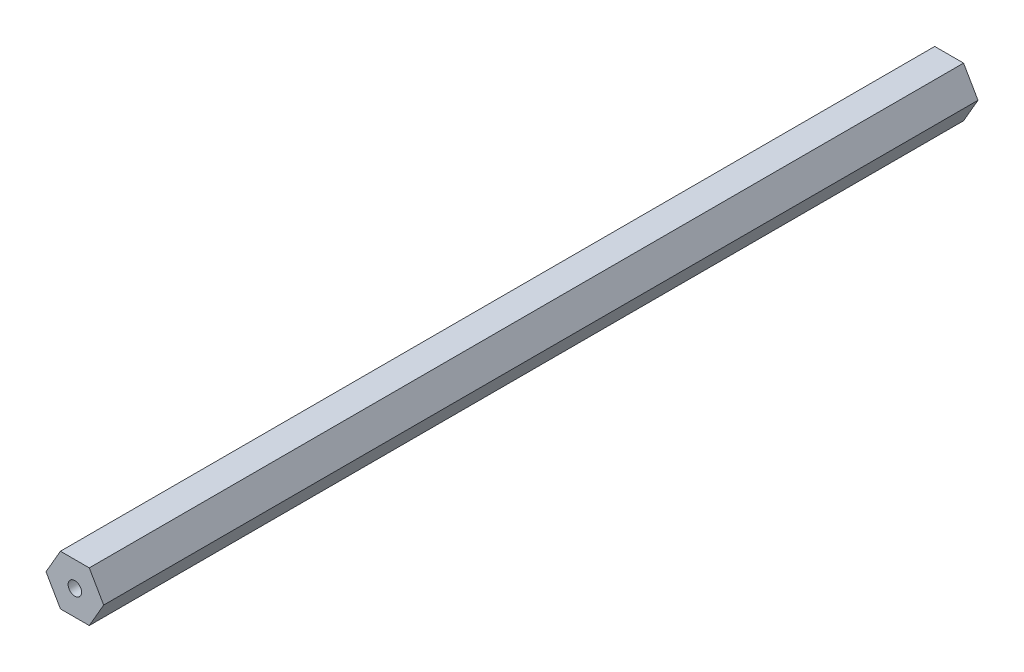
ISO-10303-21;
HEADER;
FILE_DESCRIPTION(('STEP AP214'),'2;1');
FILE_NAME('part.step','',(''),(''),'','','');
FILE_SCHEMA(('AUTOMOTIVE_DESIGN { 1 0 10303 214 1 1 1 1 }'));
ENDSEC;
DATA;
#1=APPLICATION_CONTEXT('core data for automotive mechanical design processes');
#2=APPLICATION_PROTOCOL_DEFINITION('international standard','automotive_design',2000,#1);
#3=PRODUCT_CONTEXT('',#1,'mechanical');
#4=PRODUCT('Part','Part','',(#3));
#5=PRODUCT_RELATED_PRODUCT_CATEGORY('part','',(#4));
#6=PRODUCT_DEFINITION_FORMATION('','',#4);
#7=PRODUCT_DEFINITION_CONTEXT('part definition',#1,'design');
#8=PRODUCT_DEFINITION('design','',#6,#7);
#9=PRODUCT_DEFINITION_SHAPE('','',#8);
#10=(LENGTH_UNIT() NAMED_UNIT(*) SI_UNIT(.MILLI.,.METRE.));
#11=(NAMED_UNIT(*) PLANE_ANGLE_UNIT() SI_UNIT($,.RADIAN.));
#12=(NAMED_UNIT(*) SI_UNIT($,.STERADIAN.) SOLID_ANGLE_UNIT());
#13=UNCERTAINTY_MEASURE_WITH_UNIT(LENGTH_MEASURE(1.E-05),#10,'distance_accuracy_value','');
#14=(GEOMETRIC_REPRESENTATION_CONTEXT(3) GLOBAL_UNCERTAINTY_ASSIGNED_CONTEXT((#13)) GLOBAL_UNIT_ASSIGNED_CONTEXT((#10,
#11,#12)) REPRESENTATION_CONTEXT('',''));
#15=CARTESIAN_POINT('',(0.,0.,0.));
#16=DIRECTION('',(0.,0.,1.));
#17=DIRECTION('',(1.,0.,0.));
#18=AXIS2_PLACEMENT_3D('',#15,#16,#17);
#19=CARTESIAN_POINT('',(0.,0.,222.25));
#20=DIRECTION('',(0.,0.,1.));
#21=DIRECTION('',(1.,0.,0.));
#22=AXIS2_PLACEMENT_3D('',#19,#20,#21);
#23=PLANE('',#22);
#24=DIRECTION('',(0.5,0.866025403784439,0.));
#25=VECTOR('',#24,1.);
#26=CARTESIAN_POINT('',(3.66617420935412,-6.35,222.25));
#27=LINE('',#26,#25);
#28=CARTESIAN_POINT('',(3.66617420935412,-6.35,222.25));
#29=VERTEX_POINT('',#28);
#30=CARTESIAN_POINT('',(7.33234841870825,0.,222.25));
#31=VERTEX_POINT('',#30);
#32=EDGE_CURVE('E135',#29,#31,#27,.T.);
#33=ORIENTED_EDGE('',*,*,#32,.T.);
#34=DIRECTION('',(-0.5,0.866025403784439,0.));
#35=VECTOR('',#34,1.);
#36=CARTESIAN_POINT('',(7.33234841870825,0.,222.25));
#37=LINE('',#36,#35);
#38=CARTESIAN_POINT('',(3.66617420935412,6.35,222.25));
#39=VERTEX_POINT('',#38);
#40=EDGE_CURVE('E93',#31,#39,#37,.T.);
#41=ORIENTED_EDGE('',*,*,#40,.T.);
#42=DIRECTION('',(-1.,0.,0.));
#43=VECTOR('',#42,1.);
#44=CARTESIAN_POINT('',(3.66617420935412,6.35,222.25));
#45=LINE('',#44,#43);
#46=CARTESIAN_POINT('',(-3.66617420935412,6.35,222.25));
#47=VERTEX_POINT('',#46);
#48=EDGE_CURVE('E106',#39,#47,#45,.T.);
#49=ORIENTED_EDGE('',*,*,#48,.T.);
#50=DIRECTION('',(-0.5,-0.866025403784439,0.));
#51=VECTOR('',#50,1.);
#52=CARTESIAN_POINT('',(-3.66617420935412,6.35,222.25));
#53=LINE('',#52,#51);
#54=CARTESIAN_POINT('',(-7.33234841870825,0.,222.25));
#55=VERTEX_POINT('',#54);
#56=EDGE_CURVE('E100',#47,#55,#53,.T.);
#57=ORIENTED_EDGE('',*,*,#56,.T.);
#58=DIRECTION('',(0.5,-0.866025403784439,0.));
#59=VECTOR('',#58,1.);
#60=CARTESIAN_POINT('',(-7.33234841870825,0.,222.25));
#61=LINE('',#60,#59);
#62=CARTESIAN_POINT('',(-3.66617420935413,-6.35,222.25));
#63=VERTEX_POINT('',#62);
#64=EDGE_CURVE('E104',#55,#63,#61,.T.);
#65=ORIENTED_EDGE('',*,*,#64,.T.);
#66=DIRECTION('',(1.,0.,0.));
#67=VECTOR('',#66,1.);
#68=CARTESIAN_POINT('',(-3.66617420935413,-6.35,222.25));
#69=LINE('',#68,#67);
#70=EDGE_CURVE('E56',#63,#29,#69,.T.);
#71=ORIENTED_EDGE('',*,*,#70,.T.);
#72=EDGE_LOOP('',(#33,#41,#49,#57,#65,#71));
#73=FACE_BOUND('',#72,.T.);
#74=CARTESIAN_POINT('',(0.,0.,222.25));
#75=DIRECTION('',(0.,0.,1.));
#76=DIRECTION('',(1.,0.,0.));
#77=AXIS2_PLACEMENT_3D('',#74,#75,#76);
#78=CIRCLE('',#77,1.7145);
#79=CARTESIAN_POINT('',(1.7145,0.,222.25));
#80=VERTEX_POINT('',#79);
#81=EDGE_CURVE('E128',#80,#80,#78,.T.);
#82=ORIENTED_EDGE('',*,*,#81,.F.);
#83=EDGE_LOOP('',(#82));
#84=FACE_BOUND('',#83,.T.);
#85=ADVANCED_FACE('F39',(#73,#84),#23,.T.);
#86=CARTESIAN_POINT('',(0.,0.,0.));
#87=DIRECTION('',(0.,0.,1.));
#88=DIRECTION('',(1.,0.,0.));
#89=AXIS2_PLACEMENT_3D('',#86,#87,#88);
#90=PLANE('',#89);
#91=DIRECTION('',(0.5,0.866025403784439,0.));
#92=VECTOR('',#91,1.);
#93=CARTESIAN_POINT('',(3.66617420935412,-6.35,0.));
#94=LINE('',#93,#92);
#95=CARTESIAN_POINT('',(3.66617420935412,-6.35,0.));
#96=VERTEX_POINT('',#95);
#97=CARTESIAN_POINT('',(7.33234841870825,0.,0.));
#98=VERTEX_POINT('',#97);
#99=EDGE_CURVE('E124',#96,#98,#94,.T.);
#100=ORIENTED_EDGE('',*,*,#99,.F.);
#101=DIRECTION('',(1.,0.,0.));
#102=VECTOR('',#101,1.);
#103=CARTESIAN_POINT('',(-3.66617420935413,-6.35,0.));
#104=LINE('',#103,#102);
#105=CARTESIAN_POINT('',(-3.66617420935413,-6.35,0.));
#106=VERTEX_POINT('',#105);
#107=EDGE_CURVE('E85',#106,#96,#104,.T.);
#108=ORIENTED_EDGE('',*,*,#107,.F.);
#109=DIRECTION('',(0.5,-0.866025403784439,0.));
#110=VECTOR('',#109,1.);
#111=CARTESIAN_POINT('',(-7.33234841870825,0.,0.));
#112=LINE('',#111,#110);
#113=CARTESIAN_POINT('',(-7.33234841870825,0.,0.));
#114=VERTEX_POINT('',#113);
#115=EDGE_CURVE('E79',#114,#106,#112,.T.);
#116=ORIENTED_EDGE('',*,*,#115,.F.);
#117=DIRECTION('',(-0.5,-0.866025403784439,0.));
#118=VECTOR('',#117,1.);
#119=CARTESIAN_POINT('',(-3.66617420935412,6.35,0.));
#120=LINE('',#119,#118);
#121=CARTESIAN_POINT('',(-3.66617420935412,6.35,0.));
#122=VERTEX_POINT('',#121);
#123=EDGE_CURVE('E114',#122,#114,#120,.T.);
#124=ORIENTED_EDGE('',*,*,#123,.F.);
#125=DIRECTION('',(-1.,0.,0.));
#126=VECTOR('',#125,1.);
#127=CARTESIAN_POINT('',(3.66617420935412,6.35,0.));
#128=LINE('',#127,#126);
#129=CARTESIAN_POINT('',(3.66617420935412,6.35,0.));
#130=VERTEX_POINT('',#129);
#131=EDGE_CURVE('E130',#130,#122,#128,.T.);
#132=ORIENTED_EDGE('',*,*,#131,.F.);
#133=DIRECTION('',(-0.5,0.866025403784439,0.));
#134=VECTOR('',#133,1.);
#135=CARTESIAN_POINT('',(7.33234841870825,0.,0.));
#136=LINE('',#135,#134);
#137=EDGE_CURVE('E127',#98,#130,#136,.T.);
#138=ORIENTED_EDGE('',*,*,#137,.F.);
#139=EDGE_LOOP('',(#100,#108,#116,#124,#132,#138));
#140=FACE_BOUND('',#139,.T.);
#141=CARTESIAN_POINT('',(0.,0.,0.));
#142=DIRECTION('',(0.,0.,1.));
#143=DIRECTION('',(1.,0.,0.));
#144=AXIS2_PLACEMENT_3D('',#141,#142,#143);
#145=CIRCLE('',#144,1.7145);
#146=CARTESIAN_POINT('',(1.7145,0.,0.));
#147=VERTEX_POINT('',#146);
#148=EDGE_CURVE('E228',#147,#147,#145,.T.);
#149=ORIENTED_EDGE('',*,*,#148,.T.);
#150=EDGE_LOOP('',(#149));
#151=FACE_BOUND('',#150,.T.);
#152=ADVANCED_FACE('F144',(#140,#151),#90,.F.);
#153=CARTESIAN_POINT('',(3.66617420935412,-6.35,222.25));
#154=DIRECTION('',(-0.866025403784439,0.5,0.));
#155=DIRECTION('',(-0.5,-0.866025403784439,0.));
#156=AXIS2_PLACEMENT_3D('',#153,#154,#155);
#157=PLANE('',#156);
#158=ORIENTED_EDGE('',*,*,#99,.T.);
#159=DIRECTION('',(0.,0.,-1.));
#160=VECTOR('',#159,1.);
#161=CARTESIAN_POINT('',(7.33234841870825,0.,222.25));
#162=LINE('',#161,#160);
#163=EDGE_CURVE('E11',#31,#98,#162,.T.);
#164=ORIENTED_EDGE('',*,*,#163,.F.);
#165=ORIENTED_EDGE('',*,*,#32,.F.);
#166=DIRECTION('',(0.,0.,-1.));
#167=VECTOR('',#166,1.);
#168=CARTESIAN_POINT('',(3.66617420935412,-6.35,222.25));
#169=LINE('',#168,#167);
#170=EDGE_CURVE('E120',#29,#96,#169,.T.);
#171=ORIENTED_EDGE('',*,*,#170,.T.);
#172=EDGE_LOOP('',(#158,#164,#165,#171));
#173=FACE_BOUND('',#172,.T.);
#174=ADVANCED_FACE('F41',(#173),#157,.F.);
#175=CARTESIAN_POINT('',(7.33234841870825,0.,222.25));
#176=DIRECTION('',(-0.866025403784439,-0.5,0.));
#177=DIRECTION('',(0.5,-0.866025403784439,0.));
#178=AXIS2_PLACEMENT_3D('',#175,#176,#177);
#179=PLANE('',#178);
#180=ORIENTED_EDGE('',*,*,#137,.T.);
#181=DIRECTION('',(0.,0.,-1.));
#182=VECTOR('',#181,1.);
#183=CARTESIAN_POINT('',(3.66617420935412,6.35,222.25));
#184=LINE('',#183,#182);
#185=EDGE_CURVE('E48',#39,#130,#184,.T.);
#186=ORIENTED_EDGE('',*,*,#185,.F.);
#187=ORIENTED_EDGE('',*,*,#40,.F.);
#188=ORIENTED_EDGE('',*,*,#163,.T.);
#189=EDGE_LOOP('',(#180,#186,#187,#188));
#190=FACE_BOUND('',#189,.T.);
#191=ADVANCED_FACE('F169',(#190),#179,.F.);
#192=CARTESIAN_POINT('',(3.66617420935412,6.35,222.25));
#193=DIRECTION('',(0.,-1.,0.));
#194=DIRECTION('',(1.,0.,0.));
#195=AXIS2_PLACEMENT_3D('',#192,#193,#194);
#196=PLANE('',#195);
#197=ORIENTED_EDGE('',*,*,#131,.T.);
#198=DIRECTION('',(0.,0.,-1.));
#199=VECTOR('',#198,1.);
#200=CARTESIAN_POINT('',(-3.66617420935412,6.35,222.25));
#201=LINE('',#200,#199);
#202=EDGE_CURVE('E115',#47,#122,#201,.T.);
#203=ORIENTED_EDGE('',*,*,#202,.F.);
#204=ORIENTED_EDGE('',*,*,#48,.F.);
#205=ORIENTED_EDGE('',*,*,#185,.T.);
#206=EDGE_LOOP('',(#197,#203,#204,#205));
#207=FACE_BOUND('',#206,.T.);
#208=ADVANCED_FACE('F141',(#207),#196,.F.);
#209=CARTESIAN_POINT('',(-3.66617420935412,6.35,222.25));
#210=DIRECTION('',(0.866025403784439,-0.5,0.));
#211=DIRECTION('',(0.5,0.866025403784439,0.));
#212=AXIS2_PLACEMENT_3D('',#209,#210,#211);
#213=PLANE('',#212);
#214=ORIENTED_EDGE('',*,*,#123,.T.);
#215=DIRECTION('',(0.,0.,-1.));
#216=VECTOR('',#215,1.);
#217=CARTESIAN_POINT('',(-7.33234841870825,0.,222.25));
#218=LINE('',#217,#216);
#219=EDGE_CURVE('E111',#55,#114,#218,.T.);
#220=ORIENTED_EDGE('',*,*,#219,.F.);
#221=ORIENTED_EDGE('',*,*,#56,.F.);
#222=ORIENTED_EDGE('',*,*,#202,.T.);
#223=EDGE_LOOP('',(#214,#220,#221,#222));
#224=FACE_BOUND('',#223,.T.);
#225=ADVANCED_FACE('F112',(#224),#213,.F.);
#226=CARTESIAN_POINT('',(-7.33234841870825,0.,222.25));
#227=DIRECTION('',(0.866025403784439,0.5,0.));
#228=DIRECTION('',(-0.5,0.866025403784439,0.));
#229=AXIS2_PLACEMENT_3D('',#226,#227,#228);
#230=PLANE('',#229);
#231=ORIENTED_EDGE('',*,*,#115,.T.);
#232=DIRECTION('',(0.,0.,-1.));
#233=VECTOR('',#232,1.);
#234=CARTESIAN_POINT('',(-3.66617420935413,-6.35,222.25));
#235=LINE('',#234,#233);
#236=EDGE_CURVE('E116',#63,#106,#235,.T.);
#237=ORIENTED_EDGE('',*,*,#236,.F.);
#238=ORIENTED_EDGE('',*,*,#64,.F.);
#239=ORIENTED_EDGE('',*,*,#219,.T.);
#240=EDGE_LOOP('',(#231,#237,#238,#239));
#241=FACE_BOUND('',#240,.T.);
#242=ADVANCED_FACE('F118',(#241),#230,.F.);
#243=CARTESIAN_POINT('',(-3.66617420935413,-6.35,222.25));
#244=DIRECTION('',(0.,1.,0.));
#245=DIRECTION('',(-1.,0.,0.));
#246=AXIS2_PLACEMENT_3D('',#243,#244,#245);
#247=PLANE('',#246);
#248=ORIENTED_EDGE('',*,*,#107,.T.);
#249=ORIENTED_EDGE('',*,*,#170,.F.);
#250=ORIENTED_EDGE('',*,*,#70,.F.);
#251=ORIENTED_EDGE('',*,*,#236,.T.);
#252=EDGE_LOOP('',(#248,#249,#250,#251));
#253=FACE_BOUND('',#252,.T.);
#254=ADVANCED_FACE('F149',(#253),#247,.F.);
#255=CARTESIAN_POINT('',(0.,0.,222.25));
#256=DIRECTION('',(0.,0.,-1.));
#257=DIRECTION('',(-1.,0.,0.));
#258=AXIS2_PLACEMENT_3D('',#255,#256,#257);
#259=CYLINDRICAL_SURFACE('',#258,1.7145);
#260=ORIENTED_EDGE('',*,*,#81,.T.);
#261=EDGE_LOOP('',(#260));
#262=FACE_BOUND('',#261,.T.);
#263=ORIENTED_EDGE('',*,*,#148,.F.);
#264=EDGE_LOOP('',(#263));
#265=FACE_BOUND('',#264,.T.);
#266=ADVANCED_FACE('F151',(#262,#265),#259,.F.);
#267=CLOSED_SHELL('',(#85,#152,#174,#191,#208,#225,#242,#254,#266));
#268=MANIFOLD_SOLID_BREP('B2',#267);
#269=ADVANCED_BREP_SHAPE_REPRESENTATION('',(#18,#268),#14);
#270=SHAPE_DEFINITION_REPRESENTATION(#9,#269);
ENDSEC;
END-ISO-10303-21;
